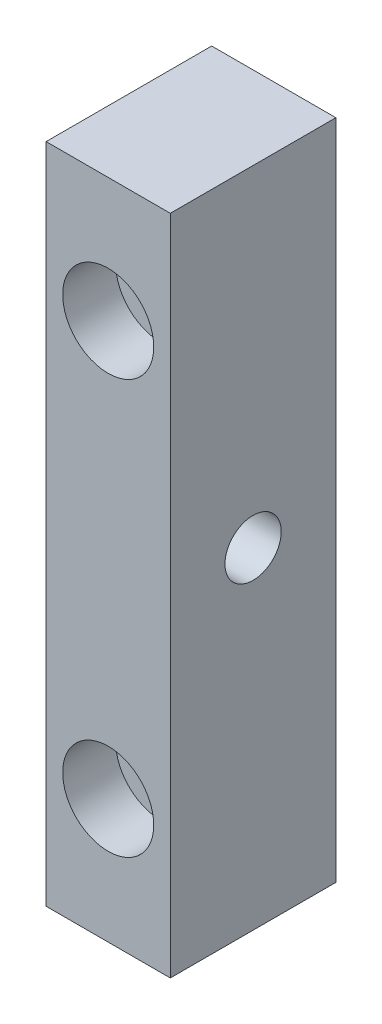
ISO-10303-21;
HEADER;
FILE_DESCRIPTION(('STEP AP214'),'2;1');
FILE_NAME('part.step','',(''),(''),'','','');
FILE_SCHEMA(('AUTOMOTIVE_DESIGN { 1 0 10303 214 1 1 1 1 }'));
ENDSEC;
DATA;
#1=APPLICATION_CONTEXT('core data for automotive mechanical design processes');
#2=APPLICATION_PROTOCOL_DEFINITION('international standard','automotive_design',2000,#1);
#3=PRODUCT_CONTEXT('',#1,'mechanical');
#4=PRODUCT('Part','Part','',(#3));
#5=PRODUCT_RELATED_PRODUCT_CATEGORY('part','',(#4));
#6=PRODUCT_DEFINITION_FORMATION('','',#4);
#7=PRODUCT_DEFINITION_CONTEXT('part definition',#1,'design');
#8=PRODUCT_DEFINITION('design','',#6,#7);
#9=PRODUCT_DEFINITION_SHAPE('','',#8);
#10=(LENGTH_UNIT() NAMED_UNIT(*) SI_UNIT(.MILLI.,.METRE.));
#11=(NAMED_UNIT(*) PLANE_ANGLE_UNIT() SI_UNIT($,.RADIAN.));
#12=(NAMED_UNIT(*) SI_UNIT($,.STERADIAN.) SOLID_ANGLE_UNIT());
#13=UNCERTAINTY_MEASURE_WITH_UNIT(LENGTH_MEASURE(1.E-05),#10,'distance_accuracy_value','');
#14=(GEOMETRIC_REPRESENTATION_CONTEXT(3) GLOBAL_UNCERTAINTY_ASSIGNED_CONTEXT((#13)) GLOBAL_UNIT_ASSIGNED_CONTEXT((#10,
#11,#12)) REPRESENTATION_CONTEXT('',''));
#15=CARTESIAN_POINT('',(0.,0.,0.));
#16=DIRECTION('',(0.,0.,1.));
#17=DIRECTION('',(1.,0.,0.));
#18=AXIS2_PLACEMENT_3D('',#15,#16,#17);
#19=CARTESIAN_POINT('',(-7.5,-40.,20.));
#20=DIRECTION('',(1.,0.,0.));
#21=DIRECTION('',(0.,0.,-1.));
#22=AXIS2_PLACEMENT_3D('',#19,#20,#21);
#23=PLANE('',#22);
#24=CARTESIAN_POINT('',(-7.5,0.,10.));
#25=DIRECTION('',(1.,0.,0.));
#26=DIRECTION('',(0.,0.,-1.));
#27=AXIS2_PLACEMENT_3D('',#24,#25,#26);
#28=CIRCLE('',#27,3.4);
#29=CARTESIAN_POINT('',(-7.5,0.,6.6));
#30=VERTEX_POINT('',#29);
#31=EDGE_CURVE('E100',#30,#30,#28,.T.);
#32=ORIENTED_EDGE('',*,*,#31,.T.);
#33=EDGE_LOOP('',(#32));
#34=FACE_BOUND('',#33,.T.);
#35=DIRECTION('',(0.,-1.,0.));
#36=VECTOR('',#35,1.);
#37=CARTESIAN_POINT('',(-7.5,-40.,0.));
#38=LINE('',#37,#36);
#39=CARTESIAN_POINT('',(-7.5,40.,0.));
#40=VERTEX_POINT('',#39);
#41=CARTESIAN_POINT('',(-7.5,-40.,0.));
#42=VERTEX_POINT('',#41);
#43=EDGE_CURVE('E97',#40,#42,#38,.T.);
#44=ORIENTED_EDGE('',*,*,#43,.T.);
#45=DIRECTION('',(0.,0.,-1.));
#46=VECTOR('',#45,1.);
#47=CARTESIAN_POINT('',(-7.5,-40.,20.));
#48=LINE('',#47,#46);
#49=CARTESIAN_POINT('',(-7.5,-40.,20.));
#50=VERTEX_POINT('',#49);
#51=EDGE_CURVE('E11',#50,#42,#48,.T.);
#52=ORIENTED_EDGE('',*,*,#51,.F.);
#53=DIRECTION('',(0.,-1.,0.));
#54=VECTOR('',#53,1.);
#55=CARTESIAN_POINT('',(-7.5,-40.,20.));
#56=LINE('',#55,#54);
#57=CARTESIAN_POINT('',(-7.5,40.,20.));
#58=VERTEX_POINT('',#57);
#59=EDGE_CURVE('E85',#58,#50,#56,.T.);
#60=ORIENTED_EDGE('',*,*,#59,.F.);
#61=DIRECTION('',(0.,0.,-1.));
#62=VECTOR('',#61,1.);
#63=CARTESIAN_POINT('',(-7.5,40.,20.));
#64=LINE('',#63,#62);
#65=EDGE_CURVE('E93',#58,#40,#64,.T.);
#66=ORIENTED_EDGE('',*,*,#65,.T.);
#67=EDGE_LOOP('',(#44,#52,#60,#66));
#68=FACE_BOUND('',#67,.T.);
#69=ADVANCED_FACE('F34',(#34,#68),#23,.F.);
#70=CARTESIAN_POINT('',(7.5,-40.,20.));
#71=DIRECTION('',(0.,1.,0.));
#72=DIRECTION('',(0.,0.,1.));
#73=AXIS2_PLACEMENT_3D('',#70,#71,#72);
#74=PLANE('',#73);
#75=DIRECTION('',(1.,0.,0.));
#76=VECTOR('',#75,1.);
#77=CARTESIAN_POINT('',(7.5,-40.,0.));
#78=LINE('',#77,#76);
#79=CARTESIAN_POINT('',(7.5,-40.,0.));
#80=VERTEX_POINT('',#79);
#81=EDGE_CURVE('E89',#42,#80,#78,.T.);
#82=ORIENTED_EDGE('',*,*,#81,.T.);
#83=DIRECTION('',(0.,0.,-1.));
#84=VECTOR('',#83,1.);
#85=CARTESIAN_POINT('',(7.5,-40.,20.));
#86=LINE('',#85,#84);
#87=CARTESIAN_POINT('',(7.5,-40.,20.));
#88=VERTEX_POINT('',#87);
#89=EDGE_CURVE('E42',#88,#80,#86,.T.);
#90=ORIENTED_EDGE('',*,*,#89,.F.);
#91=DIRECTION('',(1.,0.,0.));
#92=VECTOR('',#91,1.);
#93=CARTESIAN_POINT('',(7.5,-40.,20.));
#94=LINE('',#93,#92);
#95=EDGE_CURVE('E80',#50,#88,#94,.T.);
#96=ORIENTED_EDGE('',*,*,#95,.F.);
#97=ORIENTED_EDGE('',*,*,#51,.T.);
#98=EDGE_LOOP('',(#82,#90,#96,#97));
#99=FACE_BOUND('',#98,.T.);
#100=ADVANCED_FACE('F88',(#99),#74,.F.);
#101=CARTESIAN_POINT('',(7.5,-40.,20.));
#102=DIRECTION('',(-1.,0.,0.));
#103=DIRECTION('',(0.,0.,1.));
#104=AXIS2_PLACEMENT_3D('',#101,#102,#103);
#105=PLANE('',#104);
#106=CARTESIAN_POINT('',(7.5,0.,10.));
#107=DIRECTION('',(1.,0.,0.));
#108=DIRECTION('',(0.,0.,-1.));
#109=AXIS2_PLACEMENT_3D('',#106,#107,#108);
#110=CIRCLE('',#109,3.4);
#111=CARTESIAN_POINT('',(7.5,0.,6.6));
#112=VERTEX_POINT('',#111);
#113=EDGE_CURVE('E113',#112,#112,#110,.T.);
#114=ORIENTED_EDGE('',*,*,#113,.F.);
#115=EDGE_LOOP('',(#114));
#116=FACE_BOUND('',#115,.T.);
#117=DIRECTION('',(0.,1.,0.));
#118=VECTOR('',#117,1.);
#119=CARTESIAN_POINT('',(7.5,-40.,0.));
#120=LINE('',#119,#118);
#121=CARTESIAN_POINT('',(7.5,40.,0.));
#122=VERTEX_POINT('',#121);
#123=EDGE_CURVE('E67',#80,#122,#120,.T.);
#124=ORIENTED_EDGE('',*,*,#123,.T.);
#125=DIRECTION('',(0.,0.,-1.));
#126=VECTOR('',#125,1.);
#127=CARTESIAN_POINT('',(7.5,40.,20.));
#128=LINE('',#127,#126);
#129=CARTESIAN_POINT('',(7.5,40.,20.));
#130=VERTEX_POINT('',#129);
#131=EDGE_CURVE('E90',#130,#122,#128,.T.);
#132=ORIENTED_EDGE('',*,*,#131,.F.);
#133=DIRECTION('',(0.,1.,0.));
#134=VECTOR('',#133,1.);
#135=CARTESIAN_POINT('',(7.5,-40.,20.));
#136=LINE('',#135,#134);
#137=EDGE_CURVE('E83',#88,#130,#136,.T.);
#138=ORIENTED_EDGE('',*,*,#137,.F.);
#139=ORIENTED_EDGE('',*,*,#89,.T.);
#140=EDGE_LOOP('',(#124,#132,#138,#139));
#141=FACE_BOUND('',#140,.T.);
#142=ADVANCED_FACE('F91',(#116,#141),#105,.F.);
#143=CARTESIAN_POINT('',(7.5,40.,20.));
#144=DIRECTION('',(0.,-1.,0.));
#145=DIRECTION('',(0.,0.,-1.));
#146=AXIS2_PLACEMENT_3D('',#143,#144,#145);
#147=PLANE('',#146);
#148=DIRECTION('',(-1.,0.,0.));
#149=VECTOR('',#148,1.);
#150=CARTESIAN_POINT('',(7.5,40.,0.));
#151=LINE('',#150,#149);
#152=EDGE_CURVE('E73',#122,#40,#151,.T.);
#153=ORIENTED_EDGE('',*,*,#152,.T.);
#154=ORIENTED_EDGE('',*,*,#65,.F.);
#155=DIRECTION('',(-1.,0.,0.));
#156=VECTOR('',#155,1.);
#157=CARTESIAN_POINT('',(7.5,40.,20.));
#158=LINE('',#157,#156);
#159=EDGE_CURVE('E50',#130,#58,#158,.T.);
#160=ORIENTED_EDGE('',*,*,#159,.F.);
#161=ORIENTED_EDGE('',*,*,#131,.T.);
#162=EDGE_LOOP('',(#153,#154,#160,#161));
#163=FACE_BOUND('',#162,.T.);
#164=ADVANCED_FACE('F105',(#163),#147,.F.);
#165=CARTESIAN_POINT('',(0.,0.,20.));
#166=DIRECTION('',(0.,0.,1.));
#167=DIRECTION('',(1.,0.,0.));
#168=AXIS2_PLACEMENT_3D('',#165,#166,#167);
#169=PLANE('',#168);
#170=CARTESIAN_POINT('',(0.,25.,20.));
#171=DIRECTION('',(0.,0.,1.));
#172=DIRECTION('',(1.,0.,0.));
#173=AXIS2_PLACEMENT_3D('',#170,#171,#172);
#174=CIRCLE('',#173,5.5);
#175=CARTESIAN_POINT('',(5.5,25.,20.));
#176=VERTEX_POINT('',#175);
#177=EDGE_CURVE('E137',#176,#176,#174,.T.);
#178=ORIENTED_EDGE('',*,*,#177,.F.);
#179=EDGE_LOOP('',(#178));
#180=FACE_BOUND('',#179,.T.);
#181=CARTESIAN_POINT('',(0.,-25.,20.));
#182=DIRECTION('',(0.,0.,1.));
#183=DIRECTION('',(1.,0.,0.));
#184=AXIS2_PLACEMENT_3D('',#181,#182,#183);
#185=CIRCLE('',#184,5.5);
#186=CARTESIAN_POINT('',(5.5,-25.,20.));
#187=VERTEX_POINT('',#186);
#188=EDGE_CURVE('E125',#187,#187,#185,.T.);
#189=ORIENTED_EDGE('',*,*,#188,.F.);
#190=EDGE_LOOP('',(#189));
#191=FACE_BOUND('',#190,.T.);
#192=ORIENTED_EDGE('',*,*,#59,.T.);
#193=ORIENTED_EDGE('',*,*,#95,.T.);
#194=ORIENTED_EDGE('',*,*,#137,.T.);
#195=ORIENTED_EDGE('',*,*,#159,.T.);
#196=EDGE_LOOP('',(#192,#193,#194,#195));
#197=FACE_BOUND('',#196,.T.);
#198=ADVANCED_FACE('F81',(#180,#191,#197),#169,.T.);
#199=CARTESIAN_POINT('',(0.,0.,0.));
#200=DIRECTION('',(0.,0.,1.));
#201=DIRECTION('',(1.,0.,0.));
#202=AXIS2_PLACEMENT_3D('',#199,#200,#201);
#203=PLANE('',#202);
#204=CARTESIAN_POINT('',(0.,25.,0.));
#205=DIRECTION('',(0.,0.,1.));
#206=DIRECTION('',(1.,0.,0.));
#207=AXIS2_PLACEMENT_3D('',#204,#205,#206);
#208=CIRCLE('',#207,3.2);
#209=CARTESIAN_POINT('',(3.2,25.,0.));
#210=VERTEX_POINT('',#209);
#211=EDGE_CURVE('E128',#210,#210,#208,.T.);
#212=ORIENTED_EDGE('',*,*,#211,.T.);
#213=EDGE_LOOP('',(#212));
#214=FACE_BOUND('',#213,.T.);
#215=CARTESIAN_POINT('',(0.,-25.,0.));
#216=DIRECTION('',(0.,0.,1.));
#217=DIRECTION('',(1.,0.,0.));
#218=AXIS2_PLACEMENT_3D('',#215,#216,#217);
#219=CIRCLE('',#218,3.2);
#220=CARTESIAN_POINT('',(3.2,-25.,0.));
#221=VERTEX_POINT('',#220);
#222=EDGE_CURVE('E116',#221,#221,#219,.T.);
#223=ORIENTED_EDGE('',*,*,#222,.T.);
#224=EDGE_LOOP('',(#223));
#225=FACE_BOUND('',#224,.T.);
#226=ORIENTED_EDGE('',*,*,#43,.F.);
#227=ORIENTED_EDGE('',*,*,#152,.F.);
#228=ORIENTED_EDGE('',*,*,#123,.F.);
#229=ORIENTED_EDGE('',*,*,#81,.F.);
#230=EDGE_LOOP('',(#226,#227,#228,#229));
#231=FACE_BOUND('',#230,.T.);
#232=ADVANCED_FACE('F108',(#214,#225,#231),#203,.F.);
#233=CARTESIAN_POINT('',(7.5,0.,10.));
#234=DIRECTION('',(1.,0.,0.));
#235=DIRECTION('',(0.,0.,-1.));
#236=AXIS2_PLACEMENT_3D('',#233,#234,#235);
#237=CYLINDRICAL_SURFACE('',#236,3.4);
#238=ORIENTED_EDGE('',*,*,#113,.T.);
#239=EDGE_LOOP('',(#238));
#240=FACE_BOUND('',#239,.T.);
#241=ORIENTED_EDGE('',*,*,#31,.F.);
#242=EDGE_LOOP('',(#241));
#243=FACE_BOUND('',#242,.T.);
#244=ADVANCED_FACE('F172',(#240,#243),#237,.F.);
#245=CARTESIAN_POINT('',(0.,-25.,20.));
#246=DIRECTION('',(0.,0.,1.));
#247=DIRECTION('',(1.,0.,0.));
#248=AXIS2_PLACEMENT_3D('',#245,#246,#247);
#249=CYLINDRICAL_SURFACE('',#248,3.2);
#250=ORIENTED_EDGE('',*,*,#222,.F.);
#251=EDGE_LOOP('',(#250));
#252=FACE_BOUND('',#251,.T.);
#253=CARTESIAN_POINT('',(0.,-25.,13.6));
#254=DIRECTION('',(0.,0.,1.));
#255=DIRECTION('',(1.,0.,0.));
#256=AXIS2_PLACEMENT_3D('',#253,#254,#255);
#257=CIRCLE('',#256,3.2);
#258=CARTESIAN_POINT('',(3.2,-25.,13.6));
#259=VERTEX_POINT('',#258);
#260=EDGE_CURVE('E119',#259,#259,#257,.T.);
#261=ORIENTED_EDGE('',*,*,#260,.T.);
#262=EDGE_LOOP('',(#261));
#263=FACE_BOUND('',#262,.T.);
#264=ADVANCED_FACE('F161',(#252,#263),#249,.F.);
#265=CARTESIAN_POINT('',(3.2,-25.,13.6));
#266=DIRECTION('',(0.,0.,-1.));
#267=DIRECTION('',(-1.,0.,0.));
#268=AXIS2_PLACEMENT_3D('',#265,#266,#267);
#269=PLANE('',#268);
#270=ORIENTED_EDGE('',*,*,#260,.F.);
#271=EDGE_LOOP('',(#270));
#272=FACE_BOUND('',#271,.T.);
#273=CARTESIAN_POINT('',(0.,-25.,13.6));
#274=DIRECTION('',(0.,0.,1.));
#275=DIRECTION('',(1.,0.,0.));
#276=AXIS2_PLACEMENT_3D('',#273,#274,#275);
#277=CIRCLE('',#276,5.5);
#278=CARTESIAN_POINT('',(5.5,-25.,13.6));
#279=VERTEX_POINT('',#278);
#280=EDGE_CURVE('E122',#279,#279,#277,.T.);
#281=ORIENTED_EDGE('',*,*,#280,.T.);
#282=EDGE_LOOP('',(#281));
#283=FACE_BOUND('',#282,.T.);
#284=ADVANCED_FACE('F151',(#272,#283),#269,.F.);
#285=CARTESIAN_POINT('',(0.,-25.,20.));
#286=DIRECTION('',(0.,0.,1.));
#287=DIRECTION('',(1.,0.,0.));
#288=AXIS2_PLACEMENT_3D('',#285,#286,#287);
#289=CYLINDRICAL_SURFACE('',#288,5.5);
#290=ORIENTED_EDGE('',*,*,#280,.F.);
#291=EDGE_LOOP('',(#290));
#292=FACE_BOUND('',#291,.T.);
#293=ORIENTED_EDGE('',*,*,#188,.T.);
#294=EDGE_LOOP('',(#293));
#295=FACE_BOUND('',#294,.T.);
#296=ADVANCED_FACE('F148',(#292,#295),#289,.F.);
#297=CARTESIAN_POINT('',(0.,25.,20.));
#298=DIRECTION('',(0.,0.,1.));
#299=DIRECTION('',(1.,0.,0.));
#300=AXIS2_PLACEMENT_3D('',#297,#298,#299);
#301=CYLINDRICAL_SURFACE('',#300,3.2);
#302=ORIENTED_EDGE('',*,*,#211,.F.);
#303=EDGE_LOOP('',(#302));
#304=FACE_BOUND('',#303,.T.);
#305=CARTESIAN_POINT('',(0.,25.,13.6));
#306=DIRECTION('',(0.,0.,1.));
#307=DIRECTION('',(1.,0.,0.));
#308=AXIS2_PLACEMENT_3D('',#305,#306,#307);
#309=CIRCLE('',#308,3.2);
#310=CARTESIAN_POINT('',(3.2,25.,13.6));
#311=VERTEX_POINT('',#310);
#312=EDGE_CURVE('E131',#311,#311,#309,.T.);
#313=ORIENTED_EDGE('',*,*,#312,.T.);
#314=EDGE_LOOP('',(#313));
#315=FACE_BOUND('',#314,.T.);
#316=ADVANCED_FACE('F150',(#304,#315),#301,.F.);
#317=CARTESIAN_POINT('',(3.2,25.,13.6));
#318=DIRECTION('',(0.,0.,-1.));
#319=DIRECTION('',(-1.,0.,0.));
#320=AXIS2_PLACEMENT_3D('',#317,#318,#319);
#321=PLANE('',#320);
#322=ORIENTED_EDGE('',*,*,#312,.F.);
#323=EDGE_LOOP('',(#322));
#324=FACE_BOUND('',#323,.T.);
#325=CARTESIAN_POINT('',(0.,25.,13.6));
#326=DIRECTION('',(0.,0.,1.));
#327=DIRECTION('',(1.,0.,0.));
#328=AXIS2_PLACEMENT_3D('',#325,#326,#327);
#329=CIRCLE('',#328,5.5);
#330=CARTESIAN_POINT('',(5.5,25.,13.6));
#331=VERTEX_POINT('',#330);
#332=EDGE_CURVE('E134',#331,#331,#329,.T.);
#333=ORIENTED_EDGE('',*,*,#332,.T.);
#334=EDGE_LOOP('',(#333));
#335=FACE_BOUND('',#334,.T.);
#336=ADVANCED_FACE('F158',(#324,#335),#321,.F.);
#337=CARTESIAN_POINT('',(0.,25.,20.));
#338=DIRECTION('',(0.,0.,1.));
#339=DIRECTION('',(1.,0.,0.));
#340=AXIS2_PLACEMENT_3D('',#337,#338,#339);
#341=CYLINDRICAL_SURFACE('',#340,5.5);
#342=ORIENTED_EDGE('',*,*,#332,.F.);
#343=EDGE_LOOP('',(#342));
#344=FACE_BOUND('',#343,.T.);
#345=ORIENTED_EDGE('',*,*,#177,.T.);
#346=EDGE_LOOP('',(#345));
#347=FACE_BOUND('',#346,.T.);
#348=ADVANCED_FACE('F141',(#344,#347),#341,.F.);
#349=CLOSED_SHELL('',(#69,#100,#142,#164,#198,#232,#244,#264,#284,#296,#316,#336,#348));
#350=MANIFOLD_SOLID_BREP('B2',#349);
#351=ADVANCED_BREP_SHAPE_REPRESENTATION('',(#18,#350),#14);
#352=SHAPE_DEFINITION_REPRESENTATION(#9,#351);
ENDSEC;
END-ISO-10303-21;
